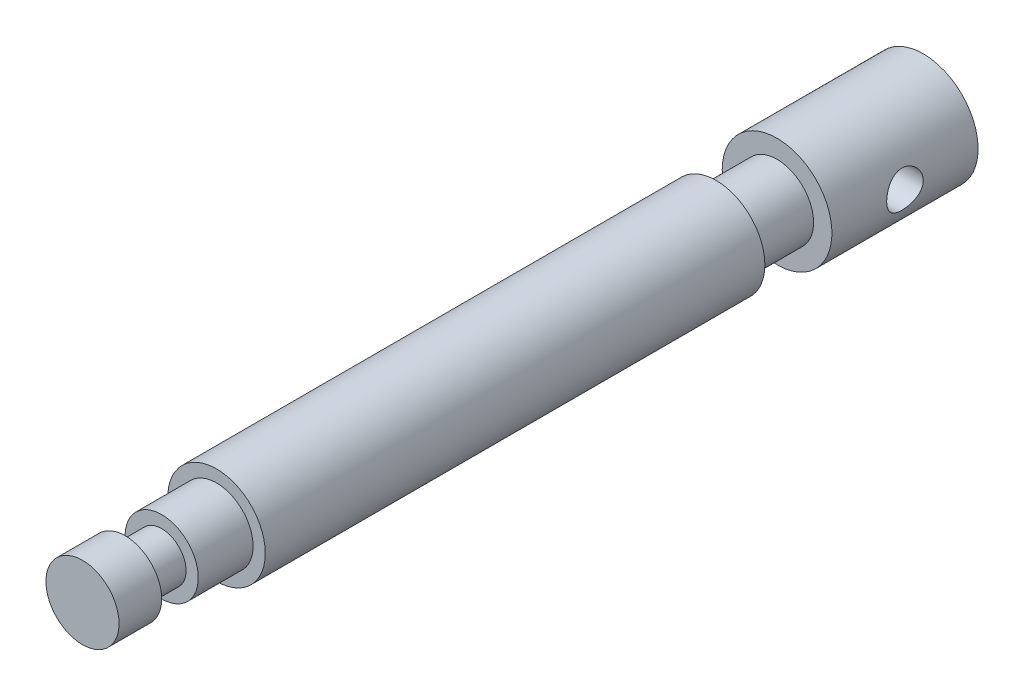
ISO-10303-21;
HEADER;
FILE_DESCRIPTION(('STEP AP214'),'2;1');
FILE_NAME('part.step','',(''),(''),'','','');
FILE_SCHEMA(('AUTOMOTIVE_DESIGN { 1 0 10303 214 1 1 1 1 }'));
ENDSEC;
DATA;
#1=APPLICATION_CONTEXT('core data for automotive mechanical design processes');
#2=APPLICATION_PROTOCOL_DEFINITION('international standard','automotive_design',2000,#1);
#3=PRODUCT_CONTEXT('',#1,'mechanical');
#4=PRODUCT('Part','Part','',(#3));
#5=PRODUCT_RELATED_PRODUCT_CATEGORY('part','',(#4));
#6=PRODUCT_DEFINITION_FORMATION('','',#4);
#7=PRODUCT_DEFINITION_CONTEXT('part definition',#1,'design');
#8=PRODUCT_DEFINITION('design','',#6,#7);
#9=PRODUCT_DEFINITION_SHAPE('','',#8);
#10=(LENGTH_UNIT() NAMED_UNIT(*) SI_UNIT(.MILLI.,.METRE.));
#11=(NAMED_UNIT(*) PLANE_ANGLE_UNIT() SI_UNIT($,.RADIAN.));
#12=(NAMED_UNIT(*) SI_UNIT($,.STERADIAN.) SOLID_ANGLE_UNIT());
#13=UNCERTAINTY_MEASURE_WITH_UNIT(LENGTH_MEASURE(1.E-05),#10,'distance_accuracy_value','');
#14=(GEOMETRIC_REPRESENTATION_CONTEXT(3) GLOBAL_UNCERTAINTY_ASSIGNED_CONTEXT((#13)) GLOBAL_UNIT_ASSIGNED_CONTEXT((#10,
#11,#12)) REPRESENTATION_CONTEXT('',''));
#15=CARTESIAN_POINT('',(0.,0.,0.));
#16=DIRECTION('',(0.,0.,1.));
#17=DIRECTION('',(1.,0.,0.));
#18=AXIS2_PLACEMENT_3D('',#15,#16,#17);
#19=CARTESIAN_POINT('',(0.,0.,41.));
#20=DIRECTION('',(0.,0.,-1.));
#21=DIRECTION('',(-1.,0.,0.));
#22=AXIS2_PLACEMENT_3D('',#19,#20,#21);
#23=CYLINDRICAL_SURFACE('',#22,8.);
#24=CARTESIAN_POINT('',(0.,0.,41.));
#25=DIRECTION('',(0.,0.,1.));
#26=DIRECTION('',(1.,0.,0.));
#27=AXIS2_PLACEMENT_3D('',#24,#25,#26);
#28=CIRCLE('',#27,8.);
#29=CARTESIAN_POINT('',(8.,0.,41.));
#30=VERTEX_POINT('',#29);
#31=EDGE_CURVE('E68',#30,#30,#28,.T.);
#32=ORIENTED_EDGE('',*,*,#31,.F.);
#33=EDGE_LOOP('',(#32));
#34=FACE_BOUND('',#33,.T.);
#35=CARTESIAN_POINT('',(0.,0.,-41.));
#36=DIRECTION('',(0.,0.,1.));
#37=DIRECTION('',(1.,0.,0.));
#38=AXIS2_PLACEMENT_3D('',#35,#36,#37);
#39=CIRCLE('',#38,8.);
#40=CARTESIAN_POINT('',(8.,0.,-41.));
#41=VERTEX_POINT('',#40);
#42=EDGE_CURVE('E65',#41,#41,#39,.T.);
#43=ORIENTED_EDGE('',*,*,#42,.T.);
#44=EDGE_LOOP('',(#43));
#45=FACE_BOUND('',#44,.T.);
#46=ADVANCED_FACE('F30',(#34,#45),#23,.T.);
#47=CARTESIAN_POINT('',(0.,0.,41.));
#48=DIRECTION('',(0.,0.,1.));
#49=DIRECTION('',(1.,0.,0.));
#50=AXIS2_PLACEMENT_3D('',#47,#48,#49);
#51=PLANE('',#50);
#52=CARTESIAN_POINT('',(0.,0.,41.));
#53=DIRECTION('',(0.,0.,1.));
#54=DIRECTION('',(1.,0.,0.));
#55=AXIS2_PLACEMENT_3D('',#52,#53,#54);
#56=CIRCLE('',#55,6.);
#57=CARTESIAN_POINT('',(6.,0.,41.));
#58=VERTEX_POINT('',#57);
#59=EDGE_CURVE('E42',#58,#58,#56,.T.);
#60=ORIENTED_EDGE('',*,*,#59,.F.);
#61=EDGE_LOOP('',(#60));
#62=FACE_BOUND('',#61,.T.);
#63=ORIENTED_EDGE('',*,*,#31,.T.);
#64=EDGE_LOOP('',(#63));
#65=FACE_BOUND('',#64,.T.);
#66=ADVANCED_FACE('F121',(#62,#65),#51,.T.);
#67=CARTESIAN_POINT('',(0.,0.,-41.));
#68=DIRECTION('',(0.,0.,1.));
#69=DIRECTION('',(1.,0.,0.));
#70=AXIS2_PLACEMENT_3D('',#67,#68,#69);
#71=PLANE('',#70);
#72=CARTESIAN_POINT('',(0.,0.,-41.));
#73=DIRECTION('',(0.,0.,-1.));
#74=DIRECTION('',(-1.,0.,0.));
#75=AXIS2_PLACEMENT_3D('',#72,#73,#74);
#76=CIRCLE('',#75,6.);
#77=CARTESIAN_POINT('',(-6.,0.,-41.));
#78=VERTEX_POINT('',#77);
#79=EDGE_CURVE('E47',#78,#78,#76,.T.);
#80=ORIENTED_EDGE('',*,*,#79,.F.);
#81=EDGE_LOOP('',(#80));
#82=FACE_BOUND('',#81,.T.);
#83=ORIENTED_EDGE('',*,*,#42,.F.);
#84=EDGE_LOOP('',(#83));
#85=FACE_BOUND('',#84,.T.);
#86=ADVANCED_FACE('F126',(#82,#85),#71,.F.);
#87=CARTESIAN_POINT('',(0.,0.,-51.));
#88=DIRECTION('',(0.,0.,1.));
#89=DIRECTION('',(1.,0.,0.));
#90=AXIS2_PLACEMENT_3D('',#87,#88,#89);
#91=CYLINDRICAL_SURFACE('',#90,6.);
#92=CARTESIAN_POINT('',(0.,0.,-51.));
#93=DIRECTION('',(0.,0.,-1.));
#94=DIRECTION('',(-1.,0.,0.));
#95=AXIS2_PLACEMENT_3D('',#92,#93,#94);
#96=CIRCLE('',#95,6.);
#97=CARTESIAN_POINT('',(-6.,0.,-51.));
#98=VERTEX_POINT('',#97);
#99=EDGE_CURVE('E60',#98,#98,#96,.T.);
#100=ORIENTED_EDGE('',*,*,#99,.F.);
#101=EDGE_LOOP('',(#100));
#102=FACE_BOUND('',#101,.T.);
#103=ORIENTED_EDGE('',*,*,#79,.T.);
#104=EDGE_LOOP('',(#103));
#105=FACE_BOUND('',#104,.T.);
#106=ADVANCED_FACE('F134',(#102,#105),#91,.T.);
#107=CARTESIAN_POINT('',(0.,0.,-75.));
#108=DIRECTION('',(0.,0.,1.));
#109=DIRECTION('',(1.,0.,0.));
#110=AXIS2_PLACEMENT_3D('',#107,#108,#109);
#111=CYLINDRICAL_SURFACE('',#110,9.);
#112=CARTESIAN_POINT('',(9.,0.,-66.));
#113=CARTESIAN_POINT('',(9.00000045902832,-0.16369008866017,-66.0000007611949));
#114=CARTESIAN_POINT('',(8.99549308522634,-0.327375583615651,-65.9865592016184));
#115=CARTESIAN_POINT('',(8.97795630609842,-0.649925282618918,-65.9333126735484));
#116=CARTESIAN_POINT('',(8.96492601606458,-0.808788984356455,-65.8935049681532));
#117=CARTESIAN_POINT('',(8.93175923719328,-1.11699836850533,-65.7890422698479));
#118=CARTESIAN_POINT('',(8.9116346319256,-1.26635947765811,-65.7244288126222));
#119=CARTESIAN_POINT('',(8.86633337152025,-1.55212481041598,-65.572376481485));
#120=CARTESIAN_POINT('',(8.84115572003334,-1.68852647087613,-65.4849331049922));
#121=CARTESIAN_POINT('',(8.78742283329015,-1.94922502506681,-65.2865225854238));
#122=CARTESIAN_POINT('',(8.75878669391354,-2.07301110089494,-65.1749062972185));
#123=CARTESIAN_POINT('',(8.70180944349364,-2.30049807810626,-64.9326985358803));
#124=CARTESIAN_POINT('',(8.67346839871647,-2.4041945564684,-64.8021028952145));
#125=CARTESIAN_POINT('',(8.61939997431821,-2.59147482668358,-64.5210446544106));
#126=CARTESIAN_POINT('',(8.59377117827064,-2.67439457466311,-64.3701187808037));
#127=CARTESIAN_POINT('',(8.54925916255803,-2.81345662163317,-64.0554717166244));
#128=CARTESIAN_POINT('',(8.53037388482236,-2.8696070921603,-63.8917544485118));
#129=CARTESIAN_POINT('',(8.50233909808131,-2.9516203845275,-63.5619803355099));
#130=CARTESIAN_POINT('',(8.49288287308833,-2.97844034481531,-63.3961883745328));
#131=CARTESIAN_POINT('',(8.48386969888522,-3.00402337000344,-63.0622087375324));
#132=CARTESIAN_POINT('',(8.4843096906819,-3.00279510481416,-62.8940218178724));
#133=CARTESIAN_POINT('',(8.4947704502454,-2.97305971111026,-62.5681901086679));
#134=CARTESIAN_POINT('',(8.50435247602598,-2.94580173950099,-62.4104147912429));
#135=CARTESIAN_POINT('',(8.53129973173652,-2.86681848854826,-62.1018197411795));
#136=CARTESIAN_POINT('',(8.54866589352322,-2.81509027977562,-61.9510008436948));
#137=CARTESIAN_POINT('',(8.58953733393746,-2.68781717418064,-61.6577617512256));
#138=CARTESIAN_POINT('',(8.61313697379351,-2.61190214612179,-61.5155159235914));
#139=CARTESIAN_POINT('',(8.66377675727179,-2.43866731890942,-61.2453872751608));
#140=CARTESIAN_POINT('',(8.69081789371391,-2.34134133709202,-61.1175086191999));
#141=CARTESIAN_POINT('',(8.74701987503223,-2.12204799804672,-60.8727252055177));
#142=CARTESIAN_POINT('',(8.77621768064528,-1.99905945022894,-60.7567419164728));
#143=CARTESIAN_POINT('',(8.8322081516111,-1.7350187099102,-60.5468062000098));
#144=CARTESIAN_POINT('',(8.85900058614202,-1.59396478698245,-60.4528558855065));
#145=CARTESIAN_POINT('',(8.90751323813381,-1.29584283913881,-60.2889110992948));
#146=CARTESIAN_POINT('',(8.92918050024118,-1.13862982924901,-60.2191635259778));
#147=CARTESIAN_POINT('',(8.96461701433304,-0.813807250093525,-60.1073904781329));
#148=CARTESIAN_POINT('',(8.97838900964638,-0.646201314464864,-60.0653553737297));
#149=CARTESIAN_POINT('',(8.99602881214321,-0.313151488587915,-60.0118330019329));
#150=CARTESIAN_POINT('',(9.00030005501184,-0.147928799594541,-59.9991005724818));
#151=CARTESIAN_POINT('',(8.99966708084482,0.182325209880712,-60.0009980207954));
#152=CARTESIAN_POINT('',(8.99476441258087,0.347356557958953,-60.0156232799396));
#153=CARTESIAN_POINT('',(8.97660074151313,0.66755959891277,-60.0708357232079));
#154=CARTESIAN_POINT('',(8.96358596133577,0.822878420504534,-60.1106586181485));
#155=CARTESIAN_POINT('',(8.9307554049021,1.12456787573873,-60.2141803334002));
#156=CARTESIAN_POINT('',(8.91093876140025,1.27093736552582,-60.2778821984034));
#157=CARTESIAN_POINT('',(8.86586793861869,1.55486488917982,-60.4292112955224));
#158=CARTESIAN_POINT('',(8.84048444267358,1.69208987765144,-60.5174237798495));
#159=CARTESIAN_POINT('',(8.78715761748787,1.95019449040676,-60.7145824500405));
#160=CARTESIAN_POINT('',(8.75921350781483,2.07106910338673,-60.8235349680953));
#161=CARTESIAN_POINT('',(8.70230543941334,2.2987575234189,-61.0649362530198));
#162=CARTESIAN_POINT('',(8.67335283262283,2.40468290773732,-61.1982276807806));
#163=CARTESIAN_POINT('',(8.61899919884126,2.59277256697073,-61.4813147034327));
#164=CARTESIAN_POINT('',(8.59359820146006,2.67493664379305,-61.6311104359022));
#165=CARTESIAN_POINT('',(8.5494717537415,2.81279079124909,-61.9430190458697));
#166=CARTESIAN_POINT('',(8.53073282378936,2.86853439649507,-62.1051062375063));
#167=CARTESIAN_POINT('',(8.50232496919348,2.95168400027807,-62.4371359501324));
#168=CARTESIAN_POINT('',(8.49265195870918,2.97910276486183,-62.6070748962131));
#169=CARTESIAN_POINT('',(8.48393576622531,3.00382884743203,-62.9405912881228));
#170=CARTESIAN_POINT('',(8.48437200772245,3.00261077192521,-63.1040470208605));
#171=CARTESIAN_POINT('',(8.49453809471602,2.97372688034609,-63.4282952247662));
#172=CARTESIAN_POINT('',(8.50426738708085,2.94606263837576,-63.5890878538653));
#173=CARTESIAN_POINT('',(8.53153572914674,2.86611543938804,-63.9004069890074));
#174=CARTESIAN_POINT('',(8.54892294067432,2.81431003804655,-64.0510704750135));
#175=CARTESIAN_POINT('',(8.58949196455405,2.68793809727925,-64.3416822208148));
#176=CARTESIAN_POINT('',(8.61267506290179,2.61336650566143,-64.481628093564));
#177=CARTESIAN_POINT('',(8.66348487678138,2.4397820777503,-64.7534510097687));
#178=CARTESIAN_POINT('',(8.69126134926411,2.33984472829375,-64.8847095056952));
#179=CARTESIAN_POINT('',(8.74750068849758,2.11992864940696,-65.1290694401526));
#180=CARTESIAN_POINT('',(8.77596374737117,1.99994425335445,-65.2421657270642));
#181=CARTESIAN_POINT('',(8.83170091576632,1.73772467076207,-65.4514332368676));
#182=CARTESIAN_POINT('',(8.8588854540377,1.59480454049919,-65.546773043253));
#183=CARTESIAN_POINT('',(8.90777973517836,1.29407207221988,-65.711971286552));
#184=CARTESIAN_POINT('',(8.92949087723789,1.13626355439705,-65.7818362377662));
#185=CARTESIAN_POINT('',(8.96416545205625,0.817480941602929,-65.891164897466));
#186=CARTESIAN_POINT('',(8.97747637267568,0.656963273029228,-65.9318473987902));
#187=CARTESIAN_POINT('',(8.99539221192665,0.330961248030743,-65.9862608420314));
#188=CARTESIAN_POINT('',(8.99999953595715,0.16547827670624,-65.9999992304896));
#189=CARTESIAN_POINT('',(9.,0.,-66.));
#190=B_SPLINE_CURVE_WITH_KNOTS('',3,(#112,#113,#114,#115,#116,#117,#118,#119,#120,#121,#122,
#123,#124,#125,#126,#127,#128,#129,#130,#131,#132,#133,#134,#135,#136,#137,#138,#139,#140,#141,
#142,#143,#144,#145,#146,#147,#148,#149,#150,#151,#152,#153,#154,#155,#156,#157,#158,#159,#160,
#161,#162,#163,#164,#165,#166,#167,#168,#169,#170,#171,#172,#173,#174,#175,#176,#177,#178,#179,
#180,#181,#182,#183,#184,#185,#186,#187,#188,#189),.UNSPECIFIED.,.T.,.F.,(4,2,2,2,2,2,2,2,2,2,2,
2,2,2,2,2,2,2,2,2,2,2,2,2,2,2,2,2,2,2,2,2,2,2,2,2,2,2,4),(0.,0.490461318078035,
0.980973555802565,1.47066801861082,1.96045913339731,2.46554052848269,2.97073299862592,
3.49045154470413,4.01001134078501,4.51205777225521,5.01394901962458,5.49290479653842,
5.97191792566447,6.45864513465393,6.94551307674624,7.45779917434103,7.97013437899857,
8.48755216951075,9.00479006631627,9.49960749525511,9.99434139492532,10.4747447393464,
10.9552093585231,11.4483119953121,11.9415654246568,12.4572306864226,12.9729002470499,
13.4875204148031,14.0019085411752,14.4898699819278,14.9778023805413,15.4564676124126,
15.9352391452793,16.4349020007542,16.9347063337134,17.4539898250531,17.9731404345737,
18.4690967512145,18.9649159811442),.UNSPECIFIED.);
#191=CARTESIAN_POINT('',(9.,0.,-66.));
#192=VERTEX_POINT('',#191);
#193=EDGE_CURVE('E33',#192,#192,#190,.T.);
#194=ORIENTED_EDGE('',*,*,#193,.T.);
#195=EDGE_LOOP('',(#194));
#196=FACE_BOUND('',#195,.T.);
#197=CARTESIAN_POINT('',(-9.,0.,-66.));
#198=CARTESIAN_POINT('',(-9.00000045902832,0.16369008866017,-66.0000007611949));
#199=CARTESIAN_POINT('',(-8.99549308522634,0.327375583615651,-65.9865592016184));
#200=CARTESIAN_POINT('',(-8.97795630609842,0.649925282618918,-65.9333126735484));
#201=CARTESIAN_POINT('',(-8.96492601606458,0.808788984356455,-65.8935049681532));
#202=CARTESIAN_POINT('',(-8.93175923719328,1.11699836850533,-65.7890422698479));
#203=CARTESIAN_POINT('',(-8.9116346319256,1.26635947765811,-65.7244288126222));
#204=CARTESIAN_POINT('',(-8.86633337152025,1.55212481041598,-65.572376481485));
#205=CARTESIAN_POINT('',(-8.84115572003334,1.68852647087613,-65.4849331049922));
#206=CARTESIAN_POINT('',(-8.78742283329015,1.94922502506681,-65.2865225854238));
#207=CARTESIAN_POINT('',(-8.75878669391354,2.07301110089494,-65.1749062972185));
#208=CARTESIAN_POINT('',(-8.70180944349364,2.30049807810626,-64.9326985358803));
#209=CARTESIAN_POINT('',(-8.67346839871647,2.4041945564684,-64.8021028952145));
#210=CARTESIAN_POINT('',(-8.61939997431821,2.59147482668358,-64.5210446544106));
#211=CARTESIAN_POINT('',(-8.59377117827064,2.67439457466311,-64.3701187808037));
#212=CARTESIAN_POINT('',(-8.54925916255803,2.81345662163317,-64.0554717166244));
#213=CARTESIAN_POINT('',(-8.53037388482236,2.8696070921603,-63.8917544485118));
#214=CARTESIAN_POINT('',(-8.50233909808131,2.9516203845275,-63.5619803355099));
#215=CARTESIAN_POINT('',(-8.49288287308833,2.97844034481531,-63.3961883745328));
#216=CARTESIAN_POINT('',(-8.48386969888522,3.00402337000344,-63.0622087375324));
#217=CARTESIAN_POINT('',(-8.4843096906819,3.00279510481416,-62.8940218178724));
#218=CARTESIAN_POINT('',(-8.4947704502454,2.97305971111026,-62.5681901086679));
#219=CARTESIAN_POINT('',(-8.50435247602598,2.94580173950099,-62.4104147912429));
#220=CARTESIAN_POINT('',(-8.53129973173652,2.86681848854826,-62.1018197411795));
#221=CARTESIAN_POINT('',(-8.54866589352322,2.81509027977562,-61.9510008436948));
#222=CARTESIAN_POINT('',(-8.58953733393746,2.68781717418064,-61.6577617512256));
#223=CARTESIAN_POINT('',(-8.61313697379351,2.61190214612179,-61.5155159235914));
#224=CARTESIAN_POINT('',(-8.66377675727179,2.43866731890942,-61.2453872751608));
#225=CARTESIAN_POINT('',(-8.69081789371391,2.34134133709202,-61.1175086191999));
#226=CARTESIAN_POINT('',(-8.74701987503223,2.12204799804672,-60.8727252055177));
#227=CARTESIAN_POINT('',(-8.77621768064528,1.99905945022894,-60.7567419164728));
#228=CARTESIAN_POINT('',(-8.8322081516111,1.7350187099102,-60.5468062000098));
#229=CARTESIAN_POINT('',(-8.85900058614202,1.59396478698245,-60.4528558855065));
#230=CARTESIAN_POINT('',(-8.90751323813381,1.29584283913881,-60.2889110992948));
#231=CARTESIAN_POINT('',(-8.92918050024118,1.13862982924901,-60.2191635259778));
#232=CARTESIAN_POINT('',(-8.96461701433304,0.813807250093525,-60.1073904781329));
#233=CARTESIAN_POINT('',(-8.97838900964638,0.646201314464864,-60.0653553737297));
#234=CARTESIAN_POINT('',(-8.99602881214321,0.313151488587915,-60.0118330019329));
#235=CARTESIAN_POINT('',(-9.00030005501184,0.147928799594541,-59.9991005724818));
#236=CARTESIAN_POINT('',(-8.99966708084482,-0.182325209880712,-60.0009980207954));
#237=CARTESIAN_POINT('',(-8.99476441258087,-0.347356557958953,-60.0156232799396));
#238=CARTESIAN_POINT('',(-8.97660074151313,-0.66755959891277,-60.0708357232079));
#239=CARTESIAN_POINT('',(-8.96358596133577,-0.822878420504534,-60.1106586181485));
#240=CARTESIAN_POINT('',(-8.9307554049021,-1.12456787573873,-60.2141803334002));
#241=CARTESIAN_POINT('',(-8.91093876140025,-1.27093736552582,-60.2778821984034));
#242=CARTESIAN_POINT('',(-8.86586793861869,-1.55486488917982,-60.4292112955224));
#243=CARTESIAN_POINT('',(-8.84048444267358,-1.69208987765144,-60.5174237798495));
#244=CARTESIAN_POINT('',(-8.78715761748787,-1.95019449040676,-60.7145824500405));
#245=CARTESIAN_POINT('',(-8.75921350781483,-2.07106910338673,-60.8235349680953));
#246=CARTESIAN_POINT('',(-8.70230543941334,-2.2987575234189,-61.0649362530198));
#247=CARTESIAN_POINT('',(-8.67335283262283,-2.40468290773732,-61.1982276807806));
#248=CARTESIAN_POINT('',(-8.61899919884126,-2.59277256697073,-61.4813147034327));
#249=CARTESIAN_POINT('',(-8.59359820146006,-2.67493664379305,-61.6311104359022));
#250=CARTESIAN_POINT('',(-8.5494717537415,-2.81279079124909,-61.9430190458697));
#251=CARTESIAN_POINT('',(-8.53073282378936,-2.86853439649507,-62.1051062375063));
#252=CARTESIAN_POINT('',(-8.50232496919348,-2.95168400027807,-62.4371359501324));
#253=CARTESIAN_POINT('',(-8.49265195870918,-2.97910276486183,-62.6070748962131));
#254=CARTESIAN_POINT('',(-8.48393576622531,-3.00382884743203,-62.9405912881228));
#255=CARTESIAN_POINT('',(-8.48437200772245,-3.00261077192521,-63.1040470208605));
#256=CARTESIAN_POINT('',(-8.49453809471602,-2.97372688034609,-63.4282952247662));
#257=CARTESIAN_POINT('',(-8.50426738708085,-2.94606263837576,-63.5890878538653));
#258=CARTESIAN_POINT('',(-8.53153572914674,-2.86611543938804,-63.9004069890074));
#259=CARTESIAN_POINT('',(-8.54892294067432,-2.81431003804655,-64.0510704750135));
#260=CARTESIAN_POINT('',(-8.58949196455405,-2.68793809727925,-64.3416822208148));
#261=CARTESIAN_POINT('',(-8.61267506290179,-2.61336650566143,-64.481628093564));
#262=CARTESIAN_POINT('',(-8.66348487678138,-2.4397820777503,-64.7534510097687));
#263=CARTESIAN_POINT('',(-8.69126134926411,-2.33984472829375,-64.8847095056952));
#264=CARTESIAN_POINT('',(-8.74750068849758,-2.11992864940696,-65.1290694401526));
#265=CARTESIAN_POINT('',(-8.77596374737117,-1.99994425335445,-65.2421657270642));
#266=CARTESIAN_POINT('',(-8.83170091576632,-1.73772467076207,-65.4514332368676));
#267=CARTESIAN_POINT('',(-8.8588854540377,-1.59480454049919,-65.546773043253));
#268=CARTESIAN_POINT('',(-8.90777973517836,-1.29407207221988,-65.711971286552));
#269=CARTESIAN_POINT('',(-8.92949087723789,-1.13626355439705,-65.7818362377662));
#270=CARTESIAN_POINT('',(-8.96416545205625,-0.817480941602929,-65.891164897466));
#271=CARTESIAN_POINT('',(-8.97747637267568,-0.656963273029228,-65.9318473987902));
#272=CARTESIAN_POINT('',(-8.99539221192665,-0.330961248030743,-65.9862608420314));
#273=CARTESIAN_POINT('',(-8.99999953595715,-0.16547827670624,-65.9999992304896));
#274=CARTESIAN_POINT('',(-9.,0.,-66.));
#275=B_SPLINE_CURVE_WITH_KNOTS('',3,(#197,#198,#199,#200,#201,#202,#203,#204,#205,#206,#207,
#208,#209,#210,#211,#212,#213,#214,#215,#216,#217,#218,#219,#220,#221,#222,#223,#224,#225,#226,
#227,#228,#229,#230,#231,#232,#233,#234,#235,#236,#237,#238,#239,#240,#241,#242,#243,#244,#245,
#246,#247,#248,#249,#250,#251,#252,#253,#254,#255,#256,#257,#258,#259,#260,#261,#262,#263,#264,
#265,#266,#267,#268,#269,#270,#271,#272,#273,#274),.UNSPECIFIED.,.T.,.F.,(4,2,2,2,2,2,2,2,2,2,2,
2,2,2,2,2,2,2,2,2,2,2,2,2,2,2,2,2,2,2,2,2,2,2,2,2,2,2,4),(0.,0.490461318078035,
0.980973555802565,1.47066801861082,1.96045913339731,2.46554052848269,2.97073299862592,
3.49045154470413,4.01001134078501,4.51205777225521,5.01394901962458,5.49290479653842,
5.97191792566447,6.45864513465393,6.94551307674624,7.45779917434103,7.97013437899857,
8.48755216951075,9.00479006631627,9.49960749525511,9.99434139492532,10.4747447393464,
10.9552093585231,11.4483119953121,11.9415654246568,12.4572306864226,12.9729002470499,
13.4875204148031,14.0019085411752,14.4898699819278,14.9778023805413,15.4564676124126,
15.9352391452793,16.4349020007542,16.9347063337134,17.4539898250531,17.9731404345737,
18.4690967512145,18.9649159811442),.UNSPECIFIED.);
#276=CARTESIAN_POINT('',(-9.,0.,-66.));
#277=VERTEX_POINT('',#276);
#278=EDGE_CURVE('E72',#277,#277,#275,.T.);
#279=ORIENTED_EDGE('',*,*,#278,.T.);
#280=EDGE_LOOP('',(#279));
#281=FACE_BOUND('',#280,.T.);
#282=CARTESIAN_POINT('',(0.,0.,-75.));
#283=DIRECTION('',(0.,0.,-1.));
#284=DIRECTION('',(-1.,0.,0.));
#285=AXIS2_PLACEMENT_3D('',#282,#283,#284);
#286=CIRCLE('',#285,9.);
#287=CARTESIAN_POINT('',(-9.,0.,-75.));
#288=VERTEX_POINT('',#287);
#289=EDGE_CURVE('E57',#288,#288,#286,.T.);
#290=ORIENTED_EDGE('',*,*,#289,.F.);
#291=EDGE_LOOP('',(#290));
#292=FACE_BOUND('',#291,.T.);
#293=CARTESIAN_POINT('',(0.,0.,-51.));
#294=DIRECTION('',(0.,0.,-1.));
#295=DIRECTION('',(-1.,0.,0.));
#296=AXIS2_PLACEMENT_3D('',#293,#294,#295);
#297=CIRCLE('',#296,9.);
#298=CARTESIAN_POINT('',(-9.,0.,-51.));
#299=VERTEX_POINT('',#298);
#300=EDGE_CURVE('E55',#299,#299,#297,.T.);
#301=ORIENTED_EDGE('',*,*,#300,.T.);
#302=EDGE_LOOP('',(#301));
#303=FACE_BOUND('',#302,.T.);
#304=ADVANCED_FACE('F77',(#196,#281,#292,#303),#111,.T.);
#305=CARTESIAN_POINT('',(0.,0.,-75.));
#306=DIRECTION('',(0.,0.,-1.));
#307=DIRECTION('',(-1.,0.,0.));
#308=AXIS2_PLACEMENT_3D('',#305,#306,#307);
#309=PLANE('',#308);
#310=ORIENTED_EDGE('',*,*,#289,.T.);
#311=EDGE_LOOP('',(#310));
#312=FACE_BOUND('',#311,.T.);
#313=ADVANCED_FACE('F112',(#312),#309,.T.);
#314=CARTESIAN_POINT('',(0.,0.,-51.));
#315=DIRECTION('',(0.,0.,-1.));
#316=DIRECTION('',(-1.,0.,0.));
#317=AXIS2_PLACEMENT_3D('',#314,#315,#316);
#318=PLANE('',#317);
#319=ORIENTED_EDGE('',*,*,#99,.T.);
#320=EDGE_LOOP('',(#319));
#321=FACE_BOUND('',#320,.T.);
#322=ORIENTED_EDGE('',*,*,#300,.F.);
#323=EDGE_LOOP('',(#322));
#324=FACE_BOUND('',#323,.T.);
#325=ADVANCED_FACE('F110',(#321,#324),#318,.F.);
#326=CARTESIAN_POINT('',(0.,0.,50.));
#327=DIRECTION('',(0.,0.,-1.));
#328=DIRECTION('',(-1.,0.,0.));
#329=AXIS2_PLACEMENT_3D('',#326,#327,#328);
#330=CYLINDRICAL_SURFACE('',#329,6.);
#331=CARTESIAN_POINT('',(0.,0.,50.));
#332=DIRECTION('',(0.,0.,1.));
#333=DIRECTION('',(1.,0.,0.));
#334=AXIS2_PLACEMENT_3D('',#331,#332,#333);
#335=CIRCLE('',#334,6.);
#336=CARTESIAN_POINT('',(6.,0.,50.));
#337=VERTEX_POINT('',#336);
#338=EDGE_CURVE('E53',#337,#337,#335,.T.);
#339=ORIENTED_EDGE('',*,*,#338,.F.);
#340=EDGE_LOOP('',(#339));
#341=FACE_BOUND('',#340,.T.);
#342=ORIENTED_EDGE('',*,*,#59,.T.);
#343=EDGE_LOOP('',(#342));
#344=FACE_BOUND('',#343,.T.);
#345=ADVANCED_FACE('F106',(#341,#344),#330,.T.);
#346=CARTESIAN_POINT('',(0.,0.,50.));
#347=DIRECTION('',(0.,0.,1.));
#348=DIRECTION('',(1.,0.,0.));
#349=AXIS2_PLACEMENT_3D('',#346,#347,#348);
#350=PLANE('',#349);
#351=CARTESIAN_POINT('',(0.,0.,50.));
#352=DIRECTION('',(0.,0.,1.));
#353=DIRECTION('',(1.,0.,0.));
#354=AXIS2_PLACEMENT_3D('',#351,#352,#353);
#355=CIRCLE('',#354,4.);
#356=CARTESIAN_POINT('',(4.,0.,50.));
#357=VERTEX_POINT('',#356);
#358=EDGE_CURVE('E10',#357,#357,#355,.T.);
#359=ORIENTED_EDGE('',*,*,#358,.F.);
#360=EDGE_LOOP('',(#359));
#361=FACE_BOUND('',#360,.T.);
#362=ORIENTED_EDGE('',*,*,#338,.T.);
#363=EDGE_LOOP('',(#362));
#364=FACE_BOUND('',#363,.T.);
#365=ADVANCED_FACE('F102',(#361,#364),#350,.T.);
#366=CARTESIAN_POINT('',(0.,0.,56.));
#367=DIRECTION('',(0.,0.,-1.));
#368=DIRECTION('',(-1.,0.,0.));
#369=AXIS2_PLACEMENT_3D('',#366,#367,#368);
#370=CYLINDRICAL_SURFACE('',#369,4.);
#371=CARTESIAN_POINT('',(0.,0.,56.));
#372=DIRECTION('',(0.,0.,1.));
#373=DIRECTION('',(1.,0.,0.));
#374=AXIS2_PLACEMENT_3D('',#371,#372,#373);
#375=CIRCLE('',#374,4.);
#376=CARTESIAN_POINT('',(4.,0.,56.));
#377=VERTEX_POINT('',#376);
#378=EDGE_CURVE('E51',#377,#377,#375,.T.);
#379=ORIENTED_EDGE('',*,*,#378,.F.);
#380=EDGE_LOOP('',(#379));
#381=FACE_BOUND('',#380,.T.);
#382=ORIENTED_EDGE('',*,*,#358,.T.);
#383=EDGE_LOOP('',(#382));
#384=FACE_BOUND('',#383,.T.);
#385=ADVANCED_FACE('F98',(#381,#384),#370,.T.);
#386=CARTESIAN_POINT('',(0.,0.,63.));
#387=DIRECTION('',(0.,0.,-1.));
#388=DIRECTION('',(-1.,0.,0.));
#389=AXIS2_PLACEMENT_3D('',#386,#387,#388);
#390=CYLINDRICAL_SURFACE('',#389,6.);
#391=CARTESIAN_POINT('',(0.,0.,63.));
#392=DIRECTION('',(0.,0.,1.));
#393=DIRECTION('',(1.,0.,0.));
#394=AXIS2_PLACEMENT_3D('',#391,#392,#393);
#395=CIRCLE('',#394,6.);
#396=CARTESIAN_POINT('',(6.,0.,63.));
#397=VERTEX_POINT('',#396);
#398=EDGE_CURVE('E160',#397,#397,#395,.T.);
#399=ORIENTED_EDGE('',*,*,#398,.F.);
#400=EDGE_LOOP('',(#399));
#401=FACE_BOUND('',#400,.T.);
#402=CARTESIAN_POINT('',(0.,0.,56.));
#403=DIRECTION('',(0.,0.,1.));
#404=DIRECTION('',(1.,0.,0.));
#405=AXIS2_PLACEMENT_3D('',#402,#403,#404);
#406=CIRCLE('',#405,6.);
#407=CARTESIAN_POINT('',(6.,0.,56.));
#408=VERTEX_POINT('',#407);
#409=EDGE_CURVE('E158',#408,#408,#406,.T.);
#410=ORIENTED_EDGE('',*,*,#409,.T.);
#411=EDGE_LOOP('',(#410));
#412=FACE_BOUND('',#411,.T.);
#413=ADVANCED_FACE('F91',(#401,#412),#390,.T.);
#414=CARTESIAN_POINT('',(0.,0.,63.));
#415=DIRECTION('',(0.,0.,1.));
#416=DIRECTION('',(1.,0.,0.));
#417=AXIS2_PLACEMENT_3D('',#414,#415,#416);
#418=PLANE('',#417);
#419=ORIENTED_EDGE('',*,*,#398,.T.);
#420=EDGE_LOOP('',(#419));
#421=FACE_BOUND('',#420,.T.);
#422=ADVANCED_FACE('F87',(#421),#418,.T.);
#423=CARTESIAN_POINT('',(0.,0.,56.));
#424=DIRECTION('',(0.,0.,1.));
#425=DIRECTION('',(1.,0.,0.));
#426=AXIS2_PLACEMENT_3D('',#423,#424,#425);
#427=PLANE('',#426);
#428=ORIENTED_EDGE('',*,*,#378,.T.);
#429=EDGE_LOOP('',(#428));
#430=FACE_BOUND('',#429,.T.);
#431=ORIENTED_EDGE('',*,*,#409,.F.);
#432=EDGE_LOOP('',(#431));
#433=FACE_BOUND('',#432,.T.);
#434=ADVANCED_FACE('F85',(#430,#433),#427,.F.);
#435=CARTESIAN_POINT('',(-25.,0.,-63.));
#436=DIRECTION('',(1.,0.,0.));
#437=DIRECTION('',(0.,0.,-1.));
#438=AXIS2_PLACEMENT_3D('',#435,#436,#437);
#439=CYLINDRICAL_SURFACE('',#438,3.00000000000001);
#440=ORIENTED_EDGE('',*,*,#278,.F.);
#441=EDGE_LOOP('',(#440));
#442=FACE_BOUND('',#441,.T.);
#443=ORIENTED_EDGE('',*,*,#193,.F.);
#444=EDGE_LOOP('',(#443));
#445=FACE_BOUND('',#444,.T.);
#446=ADVANCED_FACE('F81',(#442,#445),#439,.F.);
#447=CLOSED_SHELL('',(#46,#66,#86,#106,#304,#313,#325,#345,#365,#385,#413,#422,#434,#446));
#448=MANIFOLD_SOLID_BREP('B2',#447);
#449=ADVANCED_BREP_SHAPE_REPRESENTATION('',(#18,#448),#14);
#450=SHAPE_DEFINITION_REPRESENTATION(#9,#449);
ENDSEC;
END-ISO-10303-21;
